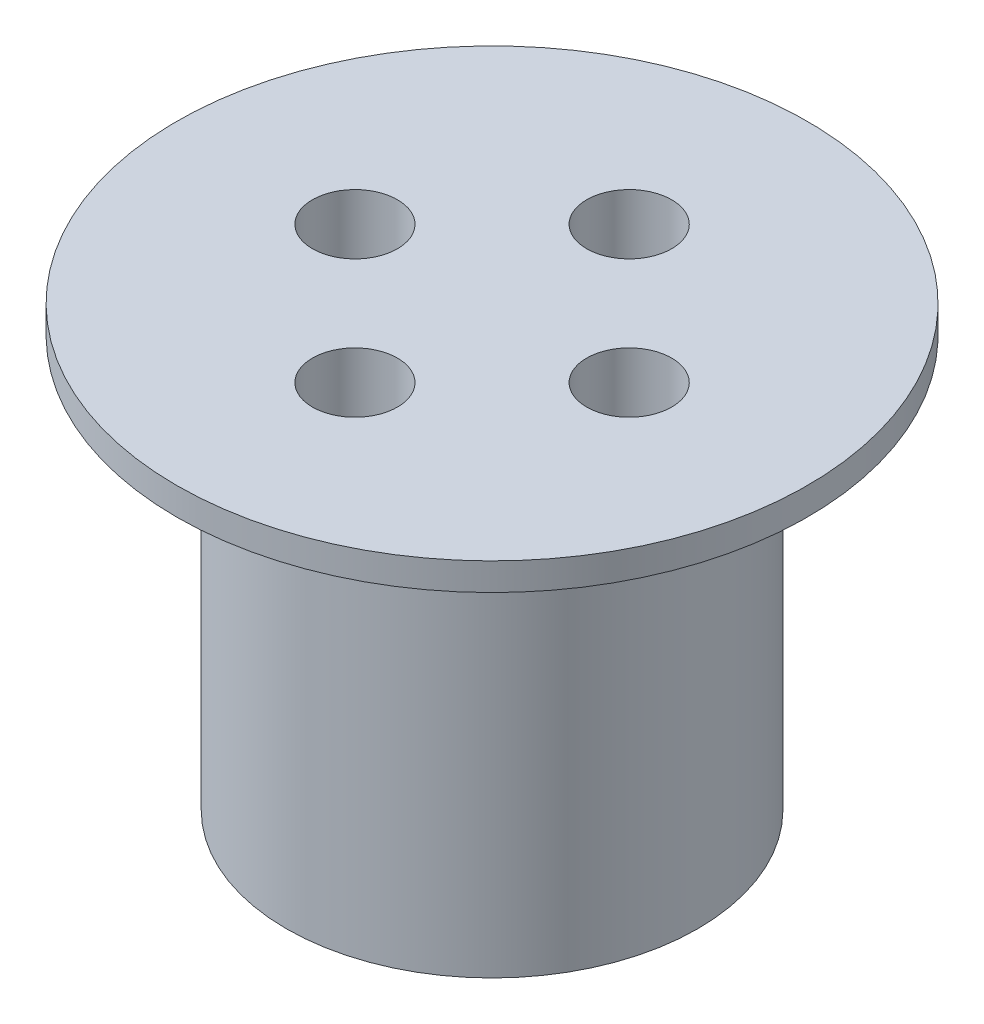
ISO-10303-21;
HEADER;
FILE_DESCRIPTION(('STEP AP214'),'2;1');
FILE_NAME('part.step','',(''),(''),'','','');
FILE_SCHEMA(('AUTOMOTIVE_DESIGN { 1 0 10303 214 1 1 1 1 }'));
ENDSEC;
DATA;
#1=APPLICATION_CONTEXT('core data for automotive mechanical design processes');
#2=APPLICATION_PROTOCOL_DEFINITION('international standard','automotive_design',2000,#1);
#3=PRODUCT_CONTEXT('',#1,'mechanical');
#4=PRODUCT('Part','Part','',(#3));
#5=PRODUCT_RELATED_PRODUCT_CATEGORY('part','',(#4));
#6=PRODUCT_DEFINITION_FORMATION('','',#4);
#7=PRODUCT_DEFINITION_CONTEXT('part definition',#1,'design');
#8=PRODUCT_DEFINITION('design','',#6,#7);
#9=PRODUCT_DEFINITION_SHAPE('','',#8);
#10=(LENGTH_UNIT() NAMED_UNIT(*) SI_UNIT(.MILLI.,.METRE.));
#11=(NAMED_UNIT(*) PLANE_ANGLE_UNIT() SI_UNIT($,.RADIAN.));
#12=(NAMED_UNIT(*) SI_UNIT($,.STERADIAN.) SOLID_ANGLE_UNIT());
#13=UNCERTAINTY_MEASURE_WITH_UNIT(LENGTH_MEASURE(1.E-05),#10,'distance_accuracy_value','');
#14=(GEOMETRIC_REPRESENTATION_CONTEXT(3) GLOBAL_UNCERTAINTY_ASSIGNED_CONTEXT((#13)) GLOBAL_UNIT_ASSIGNED_CONTEXT((#10,
#11,#12)) REPRESENTATION_CONTEXT('',''));
#15=CARTESIAN_POINT('',(0.,0.,0.));
#16=DIRECTION('',(0.,0.,1.));
#17=DIRECTION('',(1.,0.,0.));
#18=AXIS2_PLACEMENT_3D('',#15,#16,#17);
#19=CARTESIAN_POINT('',(0.,30.,0.));
#20=DIRECTION('',(0.,-1.,0.));
#21=DIRECTION('',(0.,0.,-1.));
#22=AXIS2_PLACEMENT_3D('',#19,#20,#21);
#23=CYLINDRICAL_SURFACE('',#22,15.);
#24=CARTESIAN_POINT('',(0.,30.,0.));
#25=DIRECTION('',(0.,1.,0.));
#26=DIRECTION('',(0.,0.,1.));
#27=AXIS2_PLACEMENT_3D('',#24,#25,#26);
#28=CIRCLE('',#27,15.);
#29=CARTESIAN_POINT('',(0.,30.,15.));
#30=VERTEX_POINT('',#29);
#31=EDGE_CURVE('E10',#30,#30,#28,.T.);
#32=ORIENTED_EDGE('',*,*,#31,.F.);
#33=EDGE_LOOP('',(#32));
#34=FACE_BOUND('',#33,.T.);
#35=CARTESIAN_POINT('',(0.,0.,0.));
#36=DIRECTION('',(0.,1.,0.));
#37=DIRECTION('',(0.,0.,1.));
#38=AXIS2_PLACEMENT_3D('',#35,#36,#37);
#39=CIRCLE('',#38,15.);
#40=CARTESIAN_POINT('',(0.,0.,15.));
#41=VERTEX_POINT('',#40);
#42=EDGE_CURVE('E39',#41,#41,#39,.T.);
#43=ORIENTED_EDGE('',*,*,#42,.T.);
#44=EDGE_LOOP('',(#43));
#45=FACE_BOUND('',#44,.T.);
#46=ADVANCED_FACE('F36',(#34,#45),#23,.T.);
#47=CARTESIAN_POINT('',(0.,0.,0.));
#48=DIRECTION('',(0.,1.,0.));
#49=DIRECTION('',(0.,0.,1.));
#50=AXIS2_PLACEMENT_3D('',#47,#48,#49);
#51=PLANE('',#50);
#52=CARTESIAN_POINT('',(0.,0.,10.));
#53=DIRECTION('',(0.,-1.,0.));
#54=DIRECTION('',(0.,0.,-1.));
#55=AXIS2_PLACEMENT_3D('',#52,#53,#54);
#56=CIRCLE('',#55,2.25);
#57=CARTESIAN_POINT('',(0.,0.,7.75));
#58=VERTEX_POINT('',#57);
#59=EDGE_CURVE('E83',#58,#58,#56,.T.);
#60=ORIENTED_EDGE('',*,*,#59,.F.);
#61=EDGE_LOOP('',(#60));
#62=FACE_BOUND('',#61,.T.);
#63=CARTESIAN_POINT('',(10.0000000000003,0.,2.82992447504893E-13));
#64=DIRECTION('',(0.,-1.,0.));
#65=DIRECTION('',(0.,0.,-1.));
#66=AXIS2_PLACEMENT_3D('',#63,#64,#65);
#67=CIRCLE('',#66,2.25000000000022);
#68=CARTESIAN_POINT('',(10.0000000000003,0.,-2.24999999999994));
#69=VERTEX_POINT('',#68);
#70=EDGE_CURVE('E75',#69,#69,#67,.T.);
#71=ORIENTED_EDGE('',*,*,#70,.F.);
#72=EDGE_LOOP('',(#71));
#73=FACE_BOUND('',#72,.T.);
#74=CARTESIAN_POINT('',(5.65984895009786E-13,0.,-10.));
#75=DIRECTION('',(0.,-1.,0.));
#76=DIRECTION('',(0.,0.,-1.));
#77=AXIS2_PLACEMENT_3D('',#74,#75,#76);
#78=CIRCLE('',#77,2.25000000000061);
#79=CARTESIAN_POINT('',(5.65984895009786E-13,0.,-12.2500000000006));
#80=VERTEX_POINT('',#79);
#81=EDGE_CURVE('E67',#80,#80,#78,.T.);
#82=ORIENTED_EDGE('',*,*,#81,.F.);
#83=EDGE_LOOP('',(#82));
#84=FACE_BOUND('',#83,.T.);
#85=CARTESIAN_POINT('',(-9.99999999999972,0.,-2.8421709430404E-13));
#86=DIRECTION('',(0.,-1.,0.));
#87=DIRECTION('',(0.,0.,-1.));
#88=AXIS2_PLACEMENT_3D('',#85,#86,#87);
#89=CIRCLE('',#88,2.25000000000045);
#90=CARTESIAN_POINT('',(-9.99999999999972,0.,-2.25000000000074));
#91=VERTEX_POINT('',#90);
#92=EDGE_CURVE('E58',#91,#91,#89,.T.);
#93=ORIENTED_EDGE('',*,*,#92,.F.);
#94=EDGE_LOOP('',(#93));
#95=FACE_BOUND('',#94,.T.);
#96=ORIENTED_EDGE('',*,*,#42,.F.);
#97=EDGE_LOOP('',(#96));
#98=FACE_BOUND('',#97,.T.);
#99=ADVANCED_FACE('F147',(#62,#73,#84,#95,#98),#51,.F.);
#100=CARTESIAN_POINT('',(0.,32.,0.));
#101=DIRECTION('',(0.,-1.,0.));
#102=DIRECTION('',(0.,0.,-1.));
#103=AXIS2_PLACEMENT_3D('',#100,#101,#102);
#104=CYLINDRICAL_SURFACE('',#103,23.);
#105=CARTESIAN_POINT('',(0.,32.,0.));
#106=DIRECTION('',(0.,1.,0.));
#107=DIRECTION('',(0.,0.,1.));
#108=AXIS2_PLACEMENT_3D('',#105,#106,#107);
#109=CIRCLE('',#108,23.);
#110=CARTESIAN_POINT('',(0.,32.,23.));
#111=VERTEX_POINT('',#110);
#112=EDGE_CURVE('E48',#111,#111,#109,.T.);
#113=ORIENTED_EDGE('',*,*,#112,.F.);
#114=EDGE_LOOP('',(#113));
#115=FACE_BOUND('',#114,.T.);
#116=CARTESIAN_POINT('',(0.,30.,0.));
#117=DIRECTION('',(0.,1.,0.));
#118=DIRECTION('',(0.,0.,1.));
#119=AXIS2_PLACEMENT_3D('',#116,#117,#118);
#120=CIRCLE('',#119,23.);
#121=CARTESIAN_POINT('',(0.,30.,23.));
#122=VERTEX_POINT('',#121);
#123=EDGE_CURVE('E50',#122,#122,#120,.T.);
#124=ORIENTED_EDGE('',*,*,#123,.T.);
#125=EDGE_LOOP('',(#124));
#126=FACE_BOUND('',#125,.T.);
#127=ADVANCED_FACE('F135',(#115,#126),#104,.T.);
#128=CARTESIAN_POINT('',(0.,32.,0.));
#129=DIRECTION('',(0.,1.,0.));
#130=DIRECTION('',(0.,0.,1.));
#131=AXIS2_PLACEMENT_3D('',#128,#129,#130);
#132=PLANE('',#131);
#133=CARTESIAN_POINT('',(0.,32.,-10.));
#134=DIRECTION('',(0.,1.,0.));
#135=DIRECTION('',(0.,0.,1.));
#136=AXIS2_PLACEMENT_3D('',#133,#134,#135);
#137=CIRCLE('',#136,3.1);
#138=CARTESIAN_POINT('',(0.,32.,-6.9));
#139=VERTEX_POINT('',#138);
#140=EDGE_CURVE('E114',#139,#139,#137,.T.);
#141=ORIENTED_EDGE('',*,*,#140,.F.);
#142=EDGE_LOOP('',(#141));
#143=FACE_BOUND('',#142,.T.);
#144=CARTESIAN_POINT('',(10.0000000000003,32.,-2.82992447504893E-13));
#145=DIRECTION('',(0.,1.,0.));
#146=DIRECTION('',(0.,0.,1.));
#147=AXIS2_PLACEMENT_3D('',#144,#145,#146);
#148=CIRCLE('',#147,3.10000000000022);
#149=CARTESIAN_POINT('',(10.0000000000003,32.,3.09999999999994));
#150=VERTEX_POINT('',#149);
#151=EDGE_CURVE('E106',#150,#150,#148,.T.);
#152=ORIENTED_EDGE('',*,*,#151,.F.);
#153=EDGE_LOOP('',(#152));
#154=FACE_BOUND('',#153,.T.);
#155=CARTESIAN_POINT('',(5.65984895009786E-13,32.,10.));
#156=DIRECTION('',(0.,1.,0.));
#157=DIRECTION('',(0.,0.,1.));
#158=AXIS2_PLACEMENT_3D('',#155,#156,#157);
#159=CIRCLE('',#158,3.10000000000061);
#160=CARTESIAN_POINT('',(5.65984895009786E-13,32.,13.1000000000006));
#161=VERTEX_POINT('',#160);
#162=EDGE_CURVE('E98',#161,#161,#159,.T.);
#163=ORIENTED_EDGE('',*,*,#162,.F.);
#164=EDGE_LOOP('',(#163));
#165=FACE_BOUND('',#164,.T.);
#166=CARTESIAN_POINT('',(-9.99999999999972,32.,2.8421709430404E-13));
#167=DIRECTION('',(0.,1.,0.));
#168=DIRECTION('',(0.,0.,1.));
#169=AXIS2_PLACEMENT_3D('',#166,#167,#168);
#170=CIRCLE('',#169,3.10000000000045);
#171=CARTESIAN_POINT('',(-9.99999999999972,32.,3.10000000000074));
#172=VERTEX_POINT('',#171);
#173=EDGE_CURVE('E90',#172,#172,#170,.T.);
#174=ORIENTED_EDGE('',*,*,#173,.F.);
#175=EDGE_LOOP('',(#174));
#176=FACE_BOUND('',#175,.T.);
#177=ORIENTED_EDGE('',*,*,#112,.T.);
#178=EDGE_LOOP('',(#177));
#179=FACE_BOUND('',#178,.T.);
#180=ADVANCED_FACE('F131',(#143,#154,#165,#176,#179),#132,.T.);
#181=CARTESIAN_POINT('',(0.,30.,0.));
#182=DIRECTION('',(0.,1.,0.));
#183=DIRECTION('',(0.,0.,1.));
#184=AXIS2_PLACEMENT_3D('',#181,#182,#183);
#185=PLANE('',#184);
#186=ORIENTED_EDGE('',*,*,#31,.T.);
#187=EDGE_LOOP('',(#186));
#188=FACE_BOUND('',#187,.T.);
#189=ORIENTED_EDGE('',*,*,#123,.F.);
#190=EDGE_LOOP('',(#189));
#191=FACE_BOUND('',#190,.T.);
#192=ADVANCED_FACE('F134',(#188,#191),#185,.F.);
#193=CARTESIAN_POINT('',(-9.99999999999972,10.,-2.8421709430404E-13));
#194=DIRECTION('',(0.,-1.,0.));
#195=DIRECTION('',(0.,0.,-1.));
#196=AXIS2_PLACEMENT_3D('',#193,#194,#195);
#197=CYLINDRICAL_SURFACE('',#196,2.25000000000045);
#198=CARTESIAN_POINT('',(-9.99999999999972,10.,-2.8421709430404E-13));
#199=DIRECTION('',(0.,-1.,0.));
#200=DIRECTION('',(0.,0.,-1.));
#201=AXIS2_PLACEMENT_3D('',#198,#199,#200);
#202=CIRCLE('',#201,2.25000000000045);
#203=CARTESIAN_POINT('',(-9.99999999999972,10.,-2.25000000000074));
#204=VERTEX_POINT('',#203);
#205=EDGE_CURVE('E62',#204,#204,#202,.T.);
#206=ORIENTED_EDGE('',*,*,#205,.F.);
#207=EDGE_LOOP('',(#206));
#208=FACE_BOUND('',#207,.T.);
#209=ORIENTED_EDGE('',*,*,#92,.T.);
#210=EDGE_LOOP('',(#209));
#211=FACE_BOUND('',#210,.T.);
#212=ADVANCED_FACE('F152',(#208,#211),#197,.F.);
#213=CARTESIAN_POINT('',(-9.99999999999972,10.,-2.8421709430404E-13));
#214=DIRECTION('',(0.,-1.,0.));
#215=DIRECTION('',(0.,0.,-1.));
#216=AXIS2_PLACEMENT_3D('',#213,#214,#215);
#217=PLANE('',#216);
#218=ORIENTED_EDGE('',*,*,#205,.T.);
#219=EDGE_LOOP('',(#218));
#220=FACE_BOUND('',#219,.T.);
#221=ADVANCED_FACE('F157',(#220),#217,.T.);
#222=CARTESIAN_POINT('',(5.65984895009786E-13,10.,-10.));
#223=DIRECTION('',(0.,-1.,0.));
#224=DIRECTION('',(0.,0.,-1.));
#225=AXIS2_PLACEMENT_3D('',#222,#223,#224);
#226=CYLINDRICAL_SURFACE('',#225,2.25000000000061);
#227=CARTESIAN_POINT('',(5.65984895009786E-13,10.,-10.));
#228=DIRECTION('',(0.,-1.,0.));
#229=DIRECTION('',(0.,0.,-1.));
#230=AXIS2_PLACEMENT_3D('',#227,#228,#229);
#231=CIRCLE('',#230,2.25000000000061);
#232=CARTESIAN_POINT('',(5.65984895009786E-13,10.,-12.2500000000006));
#233=VERTEX_POINT('',#232);
#234=EDGE_CURVE('E71',#233,#233,#231,.T.);
#235=ORIENTED_EDGE('',*,*,#234,.F.);
#236=EDGE_LOOP('',(#235));
#237=FACE_BOUND('',#236,.T.);
#238=ORIENTED_EDGE('',*,*,#81,.T.);
#239=EDGE_LOOP('',(#238));
#240=FACE_BOUND('',#239,.T.);
#241=ADVANCED_FACE('F180',(#237,#240),#226,.F.);
#242=CARTESIAN_POINT('',(5.65984895009786E-13,10.,-10.));
#243=DIRECTION('',(0.,-1.,0.));
#244=DIRECTION('',(0.,0.,-1.));
#245=AXIS2_PLACEMENT_3D('',#242,#243,#244);
#246=PLANE('',#245);
#247=ORIENTED_EDGE('',*,*,#234,.T.);
#248=EDGE_LOOP('',(#247));
#249=FACE_BOUND('',#248,.T.);
#250=ADVANCED_FACE('F182',(#249),#246,.T.);
#251=CARTESIAN_POINT('',(10.0000000000003,10.,2.82992447504893E-13));
#252=DIRECTION('',(0.,-1.,0.));
#253=DIRECTION('',(0.,0.,-1.));
#254=AXIS2_PLACEMENT_3D('',#251,#252,#253);
#255=CYLINDRICAL_SURFACE('',#254,2.25000000000022);
#256=CARTESIAN_POINT('',(10.0000000000003,10.,2.82992447504893E-13));
#257=DIRECTION('',(0.,-1.,0.));
#258=DIRECTION('',(0.,0.,-1.));
#259=AXIS2_PLACEMENT_3D('',#256,#257,#258);
#260=CIRCLE('',#259,2.25000000000022);
#261=CARTESIAN_POINT('',(10.0000000000003,10.,-2.24999999999994));
#262=VERTEX_POINT('',#261);
#263=EDGE_CURVE('E79',#262,#262,#260,.T.);
#264=ORIENTED_EDGE('',*,*,#263,.F.);
#265=EDGE_LOOP('',(#264));
#266=FACE_BOUND('',#265,.T.);
#267=ORIENTED_EDGE('',*,*,#70,.T.);
#268=EDGE_LOOP('',(#267));
#269=FACE_BOUND('',#268,.T.);
#270=ADVANCED_FACE('F189',(#266,#269),#255,.F.);
#271=CARTESIAN_POINT('',(10.0000000000003,10.,2.82992447504893E-13));
#272=DIRECTION('',(0.,-1.,0.));
#273=DIRECTION('',(0.,0.,-1.));
#274=AXIS2_PLACEMENT_3D('',#271,#272,#273);
#275=PLANE('',#274);
#276=ORIENTED_EDGE('',*,*,#263,.T.);
#277=EDGE_LOOP('',(#276));
#278=FACE_BOUND('',#277,.T.);
#279=ADVANCED_FACE('F198',(#278),#275,.T.);
#280=CARTESIAN_POINT('',(0.,10.,10.));
#281=DIRECTION('',(0.,-1.,0.));
#282=DIRECTION('',(0.,0.,-1.));
#283=AXIS2_PLACEMENT_3D('',#280,#281,#282);
#284=CYLINDRICAL_SURFACE('',#283,2.25);
#285=CARTESIAN_POINT('',(0.,10.,10.));
#286=DIRECTION('',(0.,-1.,0.));
#287=DIRECTION('',(0.,0.,-1.));
#288=AXIS2_PLACEMENT_3D('',#285,#286,#287);
#289=CIRCLE('',#288,2.25);
#290=CARTESIAN_POINT('',(0.,10.,7.75));
#291=VERTEX_POINT('',#290);
#292=EDGE_CURVE('E54',#291,#291,#289,.T.);
#293=ORIENTED_EDGE('',*,*,#292,.F.);
#294=EDGE_LOOP('',(#293));
#295=FACE_BOUND('',#294,.T.);
#296=ORIENTED_EDGE('',*,*,#59,.T.);
#297=EDGE_LOOP('',(#296));
#298=FACE_BOUND('',#297,.T.);
#299=ADVANCED_FACE('F202',(#295,#298),#284,.F.);
#300=CARTESIAN_POINT('',(0.,10.,10.));
#301=DIRECTION('',(0.,-1.,0.));
#302=DIRECTION('',(0.,0.,-1.));
#303=AXIS2_PLACEMENT_3D('',#300,#301,#302);
#304=PLANE('',#303);
#305=ORIENTED_EDGE('',*,*,#292,.T.);
#306=EDGE_LOOP('',(#305));
#307=FACE_BOUND('',#306,.T.);
#308=ADVANCED_FACE('F206',(#307),#304,.T.);
#309=CARTESIAN_POINT('',(-9.99999999999972,22.,2.8421709430404E-13));
#310=DIRECTION('',(0.,1.,0.));
#311=DIRECTION('',(0.,0.,1.));
#312=AXIS2_PLACEMENT_3D('',#309,#310,#311);
#313=CYLINDRICAL_SURFACE('',#312,3.10000000000045);
#314=CARTESIAN_POINT('',(-9.99999999999972,22.,2.8421709430404E-13));
#315=DIRECTION('',(0.,1.,0.));
#316=DIRECTION('',(0.,0.,1.));
#317=AXIS2_PLACEMENT_3D('',#314,#315,#316);
#318=CIRCLE('',#317,3.10000000000045);
#319=CARTESIAN_POINT('',(-9.99999999999972,22.,3.10000000000074));
#320=VERTEX_POINT('',#319);
#321=EDGE_CURVE('E94',#320,#320,#318,.T.);
#322=ORIENTED_EDGE('',*,*,#321,.F.);
#323=EDGE_LOOP('',(#322));
#324=FACE_BOUND('',#323,.T.);
#325=ORIENTED_EDGE('',*,*,#173,.T.);
#326=EDGE_LOOP('',(#325));
#327=FACE_BOUND('',#326,.T.);
#328=ADVANCED_FACE('F210',(#324,#327),#313,.F.);
#329=CARTESIAN_POINT('',(-9.99999999999972,22.,2.8421709430404E-13));
#330=DIRECTION('',(0.,1.,0.));
#331=DIRECTION('',(0.,0.,1.));
#332=AXIS2_PLACEMENT_3D('',#329,#330,#331);
#333=PLANE('',#332);
#334=ORIENTED_EDGE('',*,*,#321,.T.);
#335=EDGE_LOOP('',(#334));
#336=FACE_BOUND('',#335,.T.);
#337=ADVANCED_FACE('F214',(#336),#333,.T.);
#338=CARTESIAN_POINT('',(5.65984895009786E-13,22.,10.));
#339=DIRECTION('',(0.,1.,0.));
#340=DIRECTION('',(0.,0.,1.));
#341=AXIS2_PLACEMENT_3D('',#338,#339,#340);
#342=CYLINDRICAL_SURFACE('',#341,3.10000000000061);
#343=CARTESIAN_POINT('',(5.65984895009786E-13,22.,10.));
#344=DIRECTION('',(0.,1.,0.));
#345=DIRECTION('',(0.,0.,1.));
#346=AXIS2_PLACEMENT_3D('',#343,#344,#345);
#347=CIRCLE('',#346,3.10000000000061);
#348=CARTESIAN_POINT('',(5.65984895009786E-13,22.,13.1000000000006));
#349=VERTEX_POINT('',#348);
#350=EDGE_CURVE('E102',#349,#349,#347,.T.);
#351=ORIENTED_EDGE('',*,*,#350,.F.);
#352=EDGE_LOOP('',(#351));
#353=FACE_BOUND('',#352,.T.);
#354=ORIENTED_EDGE('',*,*,#162,.T.);
#355=EDGE_LOOP('',(#354));
#356=FACE_BOUND('',#355,.T.);
#357=ADVANCED_FACE('F218',(#353,#356),#342,.F.);
#358=CARTESIAN_POINT('',(5.65984895009786E-13,22.,10.));
#359=DIRECTION('',(0.,1.,0.));
#360=DIRECTION('',(0.,0.,1.));
#361=AXIS2_PLACEMENT_3D('',#358,#359,#360);
#362=PLANE('',#361);
#363=ORIENTED_EDGE('',*,*,#350,.T.);
#364=EDGE_LOOP('',(#363));
#365=FACE_BOUND('',#364,.T.);
#366=ADVANCED_FACE('F222',(#365),#362,.T.);
#367=CARTESIAN_POINT('',(10.0000000000003,22.,-2.82992447504893E-13));
#368=DIRECTION('',(0.,1.,0.));
#369=DIRECTION('',(0.,0.,1.));
#370=AXIS2_PLACEMENT_3D('',#367,#368,#369);
#371=CYLINDRICAL_SURFACE('',#370,3.10000000000022);
#372=CARTESIAN_POINT('',(10.0000000000003,22.,-2.82992447504893E-13));
#373=DIRECTION('',(0.,1.,0.));
#374=DIRECTION('',(0.,0.,1.));
#375=AXIS2_PLACEMENT_3D('',#372,#373,#374);
#376=CIRCLE('',#375,3.10000000000022);
#377=CARTESIAN_POINT('',(10.0000000000003,22.,3.09999999999994));
#378=VERTEX_POINT('',#377);
#379=EDGE_CURVE('E110',#378,#378,#376,.T.);
#380=ORIENTED_EDGE('',*,*,#379,.F.);
#381=EDGE_LOOP('',(#380));
#382=FACE_BOUND('',#381,.T.);
#383=ORIENTED_EDGE('',*,*,#151,.T.);
#384=EDGE_LOOP('',(#383));
#385=FACE_BOUND('',#384,.T.);
#386=ADVANCED_FACE('F226',(#382,#385),#371,.F.);
#387=CARTESIAN_POINT('',(10.0000000000003,22.,-2.82992447504893E-13));
#388=DIRECTION('',(0.,1.,0.));
#389=DIRECTION('',(0.,0.,1.));
#390=AXIS2_PLACEMENT_3D('',#387,#388,#389);
#391=PLANE('',#390);
#392=ORIENTED_EDGE('',*,*,#379,.T.);
#393=EDGE_LOOP('',(#392));
#394=FACE_BOUND('',#393,.T.);
#395=ADVANCED_FACE('F127',(#394),#391,.T.);
#396=CARTESIAN_POINT('',(0.,22.,-10.));
#397=DIRECTION('',(0.,1.,0.));
#398=DIRECTION('',(0.,0.,1.));
#399=AXIS2_PLACEMENT_3D('',#396,#397,#398);
#400=CYLINDRICAL_SURFACE('',#399,3.1);
#401=CARTESIAN_POINT('',(0.,22.,-10.));
#402=DIRECTION('',(0.,1.,0.));
#403=DIRECTION('',(0.,0.,1.));
#404=AXIS2_PLACEMENT_3D('',#401,#402,#403);
#405=CIRCLE('',#404,3.1);
#406=CARTESIAN_POINT('',(0.,22.,-6.9));
#407=VERTEX_POINT('',#406);
#408=EDGE_CURVE('E63',#407,#407,#405,.T.);
#409=ORIENTED_EDGE('',*,*,#408,.F.);
#410=EDGE_LOOP('',(#409));
#411=FACE_BOUND('',#410,.T.);
#412=ORIENTED_EDGE('',*,*,#140,.T.);
#413=EDGE_LOOP('',(#412));
#414=FACE_BOUND('',#413,.T.);
#415=ADVANCED_FACE('F124',(#411,#414),#400,.F.);
#416=CARTESIAN_POINT('',(0.,22.,-10.));
#417=DIRECTION('',(0.,1.,0.));
#418=DIRECTION('',(0.,0.,1.));
#419=AXIS2_PLACEMENT_3D('',#416,#417,#418);
#420=PLANE('',#419);
#421=ORIENTED_EDGE('',*,*,#408,.T.);
#422=EDGE_LOOP('',(#421));
#423=FACE_BOUND('',#422,.T.);
#424=ADVANCED_FACE('F122',(#423),#420,.T.);
#425=CLOSED_SHELL('',(#46,#99,#127,#180,#192,#212,#221,#241,#250,#270,#279,#299,#308,#328,#337,
#357,#366,#386,#395,#415,#424));
#426=MANIFOLD_SOLID_BREP('B2',#425);
#427=ADVANCED_BREP_SHAPE_REPRESENTATION('',(#18,#426),#14);
#428=SHAPE_DEFINITION_REPRESENTATION(#9,#427);
ENDSEC;
END-ISO-10303-21;
